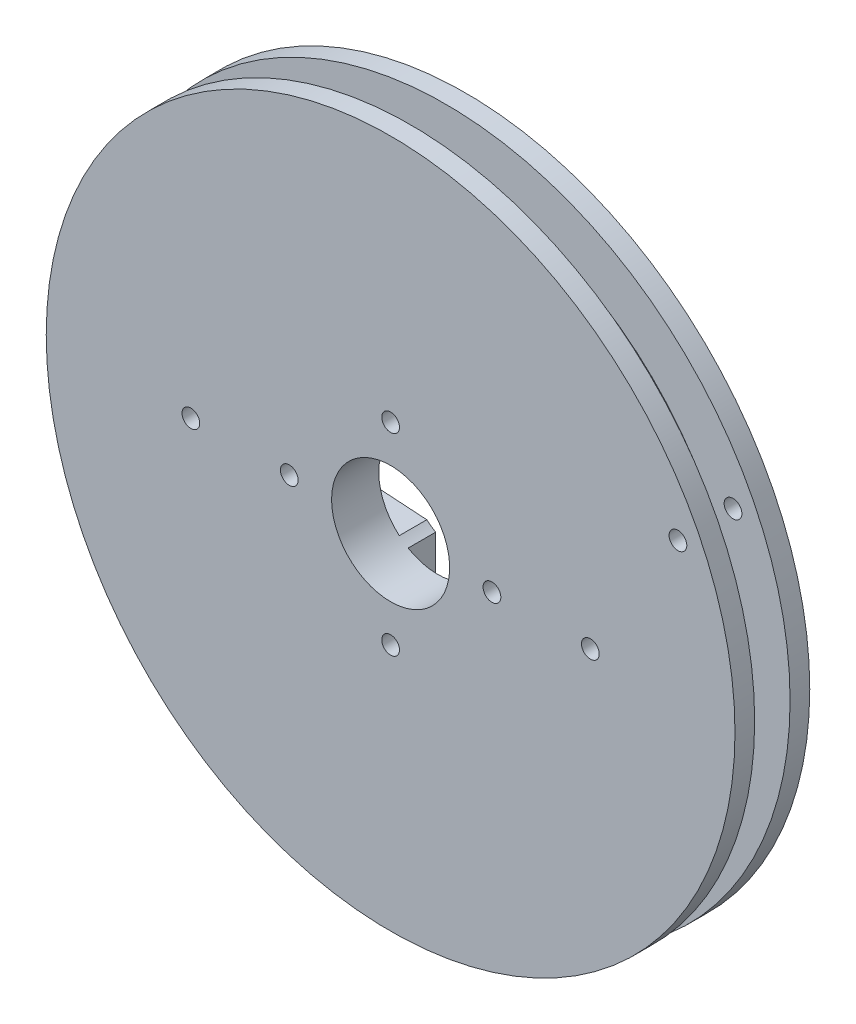
ISO-10303-21;
HEADER;
FILE_DESCRIPTION(('STEP AP214'),'2;1');
FILE_NAME('part.step','',(''),(''),'','','');
FILE_SCHEMA(('AUTOMOTIVE_DESIGN { 1 0 10303 214 1 1 1 1 }'));
ENDSEC;
DATA;
#1=APPLICATION_CONTEXT('core data for automotive mechanical design processes');
#2=APPLICATION_PROTOCOL_DEFINITION('international standard','automotive_design',2000,#1);
#3=PRODUCT_CONTEXT('',#1,'mechanical');
#4=PRODUCT('Part','Part','',(#3));
#5=PRODUCT_RELATED_PRODUCT_CATEGORY('part','',(#4));
#6=PRODUCT_DEFINITION_FORMATION('','',#4);
#7=PRODUCT_DEFINITION_CONTEXT('part definition',#1,'design');
#8=PRODUCT_DEFINITION('design','',#6,#7);
#9=PRODUCT_DEFINITION_SHAPE('','',#8);
#10=(LENGTH_UNIT() NAMED_UNIT(*) SI_UNIT(.MILLI.,.METRE.));
#11=(NAMED_UNIT(*) PLANE_ANGLE_UNIT() SI_UNIT($,.RADIAN.));
#12=(NAMED_UNIT(*) SI_UNIT($,.STERADIAN.) SOLID_ANGLE_UNIT());
#13=UNCERTAINTY_MEASURE_WITH_UNIT(LENGTH_MEASURE(1.E-05),#10,'distance_accuracy_value','');
#14=(GEOMETRIC_REPRESENTATION_CONTEXT(3) GLOBAL_UNCERTAINTY_ASSIGNED_CONTEXT((#13)) GLOBAL_UNIT_ASSIGNED_CONTEXT((#10,
#11,#12)) REPRESENTATION_CONTEXT('',''));
#15=CARTESIAN_POINT('',(0.,0.,0.));
#16=DIRECTION('',(0.,0.,1.));
#17=DIRECTION('',(1.,0.,0.));
#18=AXIS2_PLACEMENT_3D('',#15,#16,#17);
#19=CARTESIAN_POINT('',(0.,0.,1.143));
#20=DIRECTION('',(0.,0.,-1.));
#21=DIRECTION('',(-1.,0.,0.));
#22=AXIS2_PLACEMENT_3D('',#19,#20,#21);
#23=CYLINDRICAL_SURFACE('',#22,19.05);
#24=CARTESIAN_POINT('',(0.,0.,1.143));
#25=DIRECTION('',(0.,0.,1.));
#26=DIRECTION('',(1.,0.,0.));
#27=AXIS2_PLACEMENT_3D('',#24,#25,#26);
#28=CIRCLE('',#27,19.05);
#29=CARTESIAN_POINT('',(19.05,0.,1.143));
#30=VERTEX_POINT('',#29);
#31=EDGE_CURVE('E46',#30,#30,#28,.T.);
#32=ORIENTED_EDGE('',*,*,#31,.F.);
#33=EDGE_LOOP('',(#32));
#34=FACE_BOUND('',#33,.T.);
#35=CARTESIAN_POINT('',(0.,0.,-1.143));
#36=DIRECTION('',(0.,0.,1.));
#37=DIRECTION('',(1.,0.,0.));
#38=AXIS2_PLACEMENT_3D('',#35,#36,#37);
#39=CIRCLE('',#38,19.05);
#40=CARTESIAN_POINT('',(19.05,0.,-1.143));
#41=VERTEX_POINT('',#40);
#42=EDGE_CURVE('E237',#41,#41,#39,.T.);
#43=ORIENTED_EDGE('',*,*,#42,.T.);
#44=EDGE_LOOP('',(#43));
#45=FACE_BOUND('',#44,.T.);
#46=ADVANCED_FACE('F39',(#34,#45),#23,.T.);
#47=CARTESIAN_POINT('',(0.,0.,2.413));
#48=DIRECTION('',(0.,0.,-1.));
#49=DIRECTION('',(-1.,0.,0.));
#50=AXIS2_PLACEMENT_3D('',#47,#48,#49);
#51=CYLINDRICAL_SURFACE('',#50,22.225);
#52=CARTESIAN_POINT('',(0.,0.,2.413));
#53=DIRECTION('',(0.,0.,1.));
#54=DIRECTION('',(1.,0.,0.));
#55=AXIS2_PLACEMENT_3D('',#52,#53,#54);
#56=CIRCLE('',#55,22.225);
#57=CARTESIAN_POINT('',(22.225,0.,2.413));
#58=VERTEX_POINT('',#57);
#59=EDGE_CURVE('E240',#58,#58,#56,.T.);
#60=ORIENTED_EDGE('',*,*,#59,.F.);
#61=EDGE_LOOP('',(#60));
#62=FACE_BOUND('',#61,.T.);
#63=CARTESIAN_POINT('',(0.,0.,1.143));
#64=DIRECTION('',(0.,0.,1.));
#65=DIRECTION('',(1.,0.,0.));
#66=AXIS2_PLACEMENT_3D('',#63,#64,#65);
#67=CIRCLE('',#66,22.225);
#68=CARTESIAN_POINT('',(22.225,0.,1.143));
#69=VERTEX_POINT('',#68);
#70=EDGE_CURVE('E243',#69,#69,#67,.T.);
#71=ORIENTED_EDGE('',*,*,#70,.T.);
#72=EDGE_LOOP('',(#71));
#73=FACE_BOUND('',#72,.T.);
#74=ADVANCED_FACE('F279',(#62,#73),#51,.T.);
#75=CARTESIAN_POINT('',(0.,0.,2.413));
#76=DIRECTION('',(0.,0.,1.));
#77=DIRECTION('',(1.,0.,0.));
#78=AXIS2_PLACEMENT_3D('',#75,#76,#77);
#79=PLANE('',#78);
#80=CARTESIAN_POINT('',(0.,0.,2.413));
#81=DIRECTION('',(0.,0.,-1.));
#82=DIRECTION('',(-1.,0.,0.));
#83=AXIS2_PLACEMENT_3D('',#80,#81,#82);
#84=CIRCLE('',#83,3.81);
#85=CARTESIAN_POINT('',(-3.81,0.,2.413));
#86=VERTEX_POINT('',#85);
#87=EDGE_CURVE('E320',#86,#86,#84,.T.);
#88=ORIENTED_EDGE('',*,*,#87,.T.);
#89=EDGE_LOOP('',(#88));
#90=FACE_BOUND('',#89,.T.);
#91=CARTESIAN_POINT('',(0.,6.223,2.413));
#92=DIRECTION('',(0.,0.,-1.));
#93=DIRECTION('',(-1.,0.,0.));
#94=AXIS2_PLACEMENT_3D('',#91,#92,#93);
#95=CIRCLE('',#94,0.571499999999999);
#96=CARTESIAN_POINT('',(-0.571500000000004,6.223,2.413));
#97=VERTEX_POINT('',#96);
#98=EDGE_CURVE('E256',#97,#97,#95,.T.);
#99=ORIENTED_EDGE('',*,*,#98,.T.);
#100=EDGE_LOOP('',(#99));
#101=FACE_BOUND('',#100,.T.);
#102=CARTESIAN_POINT('',(0.,-6.223,2.413));
#103=DIRECTION('',(0.,0.,-1.));
#104=DIRECTION('',(-1.,0.,0.));
#105=AXIS2_PLACEMENT_3D('',#102,#103,#104);
#106=CIRCLE('',#105,0.571499999999999);
#107=CARTESIAN_POINT('',(-0.571500000000004,-6.223,2.413));
#108=VERTEX_POINT('',#107);
#109=EDGE_CURVE('E326',#108,#108,#106,.T.);
#110=ORIENTED_EDGE('',*,*,#109,.T.);
#111=EDGE_LOOP('',(#110));
#112=FACE_BOUND('',#111,.T.);
#113=CARTESIAN_POINT('',(18.542,8.89,2.413));
#114=DIRECTION('',(0.,0.,-1.));
#115=DIRECTION('',(-1.,0.,0.));
#116=AXIS2_PLACEMENT_3D('',#113,#114,#115);
#117=CIRCLE('',#116,0.571499999999999);
#118=CARTESIAN_POINT('',(17.9705,8.89,2.413));
#119=VERTEX_POINT('',#118);
#120=EDGE_CURVE('E212',#119,#119,#117,.T.);
#121=ORIENTED_EDGE('',*,*,#120,.T.);
#122=EDGE_LOOP('',(#121));
#123=FACE_BOUND('',#122,.T.);
#124=CARTESIAN_POINT('',(-12.8905,0.,2.413));
#125=DIRECTION('',(0.,0.,-1.));
#126=DIRECTION('',(-1.,0.,0.));
#127=AXIS2_PLACEMENT_3D('',#124,#125,#126);
#128=CIRCLE('',#127,0.571499999999999);
#129=CARTESIAN_POINT('',(-13.462,0.,2.413));
#130=VERTEX_POINT('',#129);
#131=EDGE_CURVE('E222',#130,#130,#128,.T.);
#132=ORIENTED_EDGE('',*,*,#131,.T.);
#133=EDGE_LOOP('',(#132));
#134=FACE_BOUND('',#133,.T.);
#135=CARTESIAN_POINT('',(6.5405,0.,2.413));
#136=DIRECTION('',(0.,0.,-1.));
#137=DIRECTION('',(1.,0.,0.));
#138=AXIS2_PLACEMENT_3D('',#135,#136,#137);
#139=CIRCLE('',#138,0.571499999999999);
#140=CARTESIAN_POINT('',(7.112,0.,2.413));
#141=VERTEX_POINT('',#140);
#142=EDGE_CURVE('E221',#141,#141,#139,.T.);
#143=ORIENTED_EDGE('',*,*,#142,.T.);
#144=EDGE_LOOP('',(#143));
#145=FACE_BOUND('',#144,.T.);
#146=CARTESIAN_POINT('',(12.8905,0.,2.413));
#147=DIRECTION('',(0.,0.,-1.));
#148=DIRECTION('',(1.,0.,0.));
#149=AXIS2_PLACEMENT_3D('',#146,#147,#148);
#150=CIRCLE('',#149,0.571499999999999);
#151=CARTESIAN_POINT('',(13.462,0.,2.413));
#152=VERTEX_POINT('',#151);
#153=EDGE_CURVE('E229',#152,#152,#150,.T.);
#154=ORIENTED_EDGE('',*,*,#153,.T.);
#155=EDGE_LOOP('',(#154));
#156=FACE_BOUND('',#155,.T.);
#157=CARTESIAN_POINT('',(-6.5405,0.,2.413));
#158=DIRECTION('',(0.,0.,-1.));
#159=DIRECTION('',(-1.,0.,0.));
#160=AXIS2_PLACEMENT_3D('',#157,#158,#159);
#161=CIRCLE('',#160,0.5715);
#162=CARTESIAN_POINT('',(-7.112,0.,2.413));
#163=VERTEX_POINT('',#162);
#164=EDGE_CURVE('E226',#163,#163,#161,.T.);
#165=ORIENTED_EDGE('',*,*,#164,.T.);
#166=EDGE_LOOP('',(#165));
#167=FACE_BOUND('',#166,.T.);
#168=ORIENTED_EDGE('',*,*,#59,.T.);
#169=EDGE_LOOP('',(#168));
#170=FACE_BOUND('',#169,.T.);
#171=ADVANCED_FACE('F284',(#90,#101,#112,#123,#134,#145,#156,#167,#170),#79,.T.);
#172=CARTESIAN_POINT('',(0.,0.,1.143));
#173=DIRECTION('',(0.,0.,1.));
#174=DIRECTION('',(1.,0.,0.));
#175=AXIS2_PLACEMENT_3D('',#172,#173,#174);
#176=PLANE('',#175);
#177=CARTESIAN_POINT('',(18.542,8.89,1.143));
#178=DIRECTION('',(0.,0.,1.));
#179=DIRECTION('',(1.,0.,0.));
#180=AXIS2_PLACEMENT_3D('',#177,#178,#179);
#181=CIRCLE('',#180,0.571499999999999);
#182=CARTESIAN_POINT('',(19.1135,8.89,1.143));
#183=VERTEX_POINT('',#182);
#184=EDGE_CURVE('E218',#183,#183,#181,.T.);
#185=ORIENTED_EDGE('',*,*,#184,.T.);
#186=EDGE_LOOP('',(#185));
#187=FACE_BOUND('',#186,.T.);
#188=ORIENTED_EDGE('',*,*,#31,.T.);
#189=EDGE_LOOP('',(#188));
#190=FACE_BOUND('',#189,.T.);
#191=ORIENTED_EDGE('',*,*,#70,.F.);
#192=EDGE_LOOP('',(#191));
#193=FACE_BOUND('',#192,.T.);
#194=ADVANCED_FACE('F301',(#187,#190,#193),#176,.F.);
#195=CARTESIAN_POINT('',(0.,0.,-2.413));
#196=DIRECTION('',(0.,0.,1.));
#197=DIRECTION('',(1.,0.,0.));
#198=AXIS2_PLACEMENT_3D('',#195,#196,#197);
#199=CYLINDRICAL_SURFACE('',#198,22.225);
#200=CARTESIAN_POINT('',(0.,0.,-2.413));
#201=DIRECTION('',(0.,0.,1.));
#202=DIRECTION('',(1.,0.,0.));
#203=AXIS2_PLACEMENT_3D('',#200,#201,#202);
#204=CIRCLE('',#203,22.225);
#205=CARTESIAN_POINT('',(22.225,0.,-2.413));
#206=VERTEX_POINT('',#205);
#207=EDGE_CURVE('E234',#206,#206,#204,.T.);
#208=ORIENTED_EDGE('',*,*,#207,.T.);
#209=EDGE_LOOP('',(#208));
#210=FACE_BOUND('',#209,.T.);
#211=CARTESIAN_POINT('',(0.,0.,-1.143));
#212=DIRECTION('',(0.,0.,1.));
#213=DIRECTION('',(1.,0.,0.));
#214=AXIS2_PLACEMENT_3D('',#211,#212,#213);
#215=CIRCLE('',#214,22.225);
#216=CARTESIAN_POINT('',(22.225,0.,-1.143));
#217=VERTEX_POINT('',#216);
#218=EDGE_CURVE('E225',#217,#217,#215,.T.);
#219=ORIENTED_EDGE('',*,*,#218,.F.);
#220=EDGE_LOOP('',(#219));
#221=FACE_BOUND('',#220,.T.);
#222=ADVANCED_FACE('F299',(#210,#221),#199,.T.);
#223=CARTESIAN_POINT('',(0.,0.,-2.413));
#224=DIRECTION('',(0.,0.,-1.));
#225=DIRECTION('',(1.,0.,0.));
#226=AXIS2_PLACEMENT_3D('',#223,#224,#225);
#227=PLANE('',#226);
#228=CARTESIAN_POINT('',(0.,0.,-2.413));
#229=DIRECTION('',(0.,0.,-1.));
#230=DIRECTION('',(-1.,0.,0.));
#231=AXIS2_PLACEMENT_3D('',#228,#229,#230);
#232=CIRCLE('',#231,3.81);
#233=CARTESIAN_POINT('',(-2.48973260777059,2.88397842256211,-2.413));
#234=VERTEX_POINT('',#233);
#235=CARTESIAN_POINT('',(-1.9177,3.29219177904326,-2.413));
#236=VERTEX_POINT('',#235);
#237=EDGE_CURVE('E696',#234,#236,#232,.T.);
#238=ORIENTED_EDGE('',*,*,#237,.F.);
#239=DIRECTION('',(0.99791225923342,0.0645842308280507,0.));
#240=VECTOR('',#239,1.);
#241=CARTESIAN_POINT('',(-14.6727728627614,2.0955,-2.413));
#242=LINE('',#241,#240);
#243=CARTESIAN_POINT('',(-14.6727728627614,2.0955,-2.413));
#244=VERTEX_POINT('',#243);
#245=EDGE_CURVE('E177',#244,#234,#242,.T.);
#246=ORIENTED_EDGE('',*,*,#245,.F.);
#247=CARTESIAN_POINT('',(-14.2441036652242,0.,-2.413));
#248=DIRECTION('',(0.,0.,-1.));
#249=DIRECTION('',(-1.,0.,0.));
#250=AXIS2_PLACEMENT_3D('',#247,#248,#249);
#251=CIRCLE('',#250,2.13889633477575);
#252=CARTESIAN_POINT('',(-14.6727728627614,-2.0955,-2.413));
#253=VERTEX_POINT('',#252);
#254=EDGE_CURVE('E174',#253,#244,#251,.T.);
#255=ORIENTED_EDGE('',*,*,#254,.F.);
#256=DIRECTION('',(-0.99791225923342,0.0645842308280507,0.));
#257=VECTOR('',#256,1.);
#258=CARTESIAN_POINT('',(-14.6727728627614,-2.0955,-2.413));
#259=LINE('',#258,#257);
#260=CARTESIAN_POINT('',(-2.48973260777059,-2.88397842256211,-2.413));
#261=VERTEX_POINT('',#260);
#262=EDGE_CURVE('E172',#261,#253,#259,.T.);
#263=ORIENTED_EDGE('',*,*,#262,.F.);
#264=CARTESIAN_POINT('',(-1.9177,-3.29219177904326,-2.413));
#265=VERTEX_POINT('',#264);
#266=EDGE_CURVE('E698',#265,#261,#232,.T.);
#267=ORIENTED_EDGE('',*,*,#266,.F.);
#268=DIRECTION('',(0.,1.,0.));
#269=VECTOR('',#268,1.);
#270=CARTESIAN_POINT('',(-1.9177,-2.921,-2.413));
#271=LINE('',#270,#269);
#272=CARTESIAN_POINT('',(-1.9177,-6.4262,-2.413));
#273=VERTEX_POINT('',#272);
#274=EDGE_CURVE('E169',#273,#265,#271,.T.);
#275=ORIENTED_EDGE('',*,*,#274,.F.);
#276=CARTESIAN_POINT('',(0.,-6.4262,-2.413));
#277=DIRECTION('',(0.,0.,-1.));
#278=DIRECTION('',(-1.,0.,0.));
#279=AXIS2_PLACEMENT_3D('',#276,#277,#278);
#280=CIRCLE('',#279,1.9177);
#281=CARTESIAN_POINT('',(1.9177,-6.4262,-2.413));
#282=VERTEX_POINT('',#281);
#283=EDGE_CURVE('E166',#282,#273,#280,.T.);
#284=ORIENTED_EDGE('',*,*,#283,.F.);
#285=DIRECTION('',(0.,-1.,0.));
#286=VECTOR('',#285,1.);
#287=CARTESIAN_POINT('',(1.9177,-3.6195,-2.413));
#288=LINE('',#287,#286);
#289=CARTESIAN_POINT('',(1.9177,-3.6195,-2.413));
#290=VERTEX_POINT('',#289);
#291=EDGE_CURVE('E163',#290,#282,#288,.T.);
#292=ORIENTED_EDGE('',*,*,#291,.F.);
#293=DIRECTION('',(-0.994868229274418,-0.101179080744909,0.));
#294=VECTOR('',#293,1.);
#295=CARTESIAN_POINT('',(16.9028053226781,-2.0955,-2.413));
#296=LINE('',#295,#294);
#297=CARTESIAN_POINT('',(16.9028053226781,-2.0955,-2.413));
#298=VERTEX_POINT('',#297);
#299=EDGE_CURVE('E160',#298,#290,#296,.T.);
#300=ORIENTED_EDGE('',*,*,#299,.F.);
#301=CARTESIAN_POINT('',(16.6896909046454,0.,-2.413));
#302=DIRECTION('',(0.,0.,-1.));
#303=DIRECTION('',(1.,0.,0.));
#304=AXIS2_PLACEMENT_3D('',#301,#302,#303);
#305=CIRCLE('',#304,2.10630909535457);
#306=CARTESIAN_POINT('',(16.9028053226781,2.0955,-2.413));
#307=VERTEX_POINT('',#306);
#308=EDGE_CURVE('E156',#307,#298,#305,.T.);
#309=ORIENTED_EDGE('',*,*,#308,.F.);
#310=DIRECTION('',(0.994868229274418,-0.101179080744909,0.));
#311=VECTOR('',#310,1.);
#312=CARTESIAN_POINT('',(16.9028053226781,2.0955,-2.413));
#313=LINE('',#312,#311);
#314=CARTESIAN_POINT('',(1.9177,3.6195,-2.413));
#315=VERTEX_POINT('',#314);
#316=EDGE_CURVE('E154',#315,#307,#313,.T.);
#317=ORIENTED_EDGE('',*,*,#316,.F.);
#318=DIRECTION('',(0.,-1.,0.));
#319=VECTOR('',#318,1.);
#320=CARTESIAN_POINT('',(1.9177,3.6195,-2.413));
#321=LINE('',#320,#319);
#322=CARTESIAN_POINT('',(1.9177,6.4262,-2.413));
#323=VERTEX_POINT('',#322);
#324=EDGE_CURVE('E183',#323,#315,#321,.T.);
#325=ORIENTED_EDGE('',*,*,#324,.F.);
#326=CARTESIAN_POINT('',(0.,6.4262,-2.413));
#327=DIRECTION('',(0.,0.,-1.));
#328=DIRECTION('',(1.,0.,0.));
#329=AXIS2_PLACEMENT_3D('',#326,#327,#328);
#330=CIRCLE('',#329,1.9177);
#331=CARTESIAN_POINT('',(-1.9177,6.4262,-2.413));
#332=VERTEX_POINT('',#331);
#333=EDGE_CURVE('E181',#332,#323,#330,.T.);
#334=ORIENTED_EDGE('',*,*,#333,.F.);
#335=DIRECTION('',(0.,1.,0.));
#336=VECTOR('',#335,1.);
#337=CARTESIAN_POINT('',(-1.9177,2.921,-2.413));
#338=LINE('',#337,#336);
#339=EDGE_CURVE('E141',#236,#332,#338,.T.);
#340=ORIENTED_EDGE('',*,*,#339,.F.);
#341=EDGE_LOOP('',(#238,#246,#255,#263,#267,#275,#284,#292,#300,#309,#317,#325,#334,#340));
#342=FACE_BOUND('',#341,.T.);
#343=CARTESIAN_POINT('',(18.542,8.89,-2.413));
#344=DIRECTION('',(0.,0.,-1.));
#345=DIRECTION('',(-1.,0.,0.));
#346=AXIS2_PLACEMENT_3D('',#343,#344,#345);
#347=CIRCLE('',#346,0.571499999999999);
#348=CARTESIAN_POINT('',(17.9705,8.89,-2.413));
#349=VERTEX_POINT('',#348);
#350=EDGE_CURVE('E211',#349,#349,#347,.T.);
#351=ORIENTED_EDGE('',*,*,#350,.F.);
#352=EDGE_LOOP('',(#351));
#353=FACE_BOUND('',#352,.T.);
#354=ORIENTED_EDGE('',*,*,#207,.F.);
#355=EDGE_LOOP('',(#354));
#356=FACE_BOUND('',#355,.T.);
#357=ADVANCED_FACE('F294',(#342,#353,#356),#227,.T.);
#358=CARTESIAN_POINT('',(0.,0.,-1.143));
#359=DIRECTION('',(0.,0.,-1.));
#360=DIRECTION('',(1.,0.,0.));
#361=AXIS2_PLACEMENT_3D('',#358,#359,#360);
#362=PLANE('',#361);
#363=CARTESIAN_POINT('',(18.542,8.89,-1.143));
#364=DIRECTION('',(0.,0.,-1.));
#365=DIRECTION('',(-1.,0.,0.));
#366=AXIS2_PLACEMENT_3D('',#363,#364,#365);
#367=CIRCLE('',#366,0.571499999999999);
#368=CARTESIAN_POINT('',(17.9705,8.89,-1.143));
#369=VERTEX_POINT('',#368);
#370=EDGE_CURVE('E215',#369,#369,#367,.T.);
#371=ORIENTED_EDGE('',*,*,#370,.T.);
#372=EDGE_LOOP('',(#371));
#373=FACE_BOUND('',#372,.T.);
#374=ORIENTED_EDGE('',*,*,#42,.F.);
#375=EDGE_LOOP('',(#374));
#376=FACE_BOUND('',#375,.T.);
#377=ORIENTED_EDGE('',*,*,#218,.T.);
#378=EDGE_LOOP('',(#377));
#379=FACE_BOUND('',#378,.T.);
#380=ADVANCED_FACE('F290',(#373,#376,#379),#362,.F.);
#381=CARTESIAN_POINT('',(-6.5405,0.,2.413));
#382=DIRECTION('',(0.,0.,-1.));
#383=DIRECTION('',(-1.,0.,0.));
#384=AXIS2_PLACEMENT_3D('',#381,#382,#383);
#385=CYLINDRICAL_SURFACE('',#384,0.5715);
#386=CARTESIAN_POINT('',(-6.5405,0.,-0.635));
#387=DIRECTION('',(0.,0.,1.));
#388=DIRECTION('',(1.,0.,0.));
#389=AXIS2_PLACEMENT_3D('',#386,#387,#388);
#390=CIRCLE('',#389,0.5715);
#391=CARTESIAN_POINT('',(-5.969,0.,-0.635));
#392=VERTEX_POINT('',#391);
#393=EDGE_CURVE('E208',#392,#392,#390,.F.);
#394=ORIENTED_EDGE('',*,*,#393,.T.);
#395=EDGE_LOOP('',(#394));
#396=FACE_BOUND('',#395,.T.);
#397=ORIENTED_EDGE('',*,*,#164,.F.);
#398=EDGE_LOOP('',(#397));
#399=FACE_BOUND('',#398,.T.);
#400=ADVANCED_FACE('F293',(#396,#399),#385,.F.);
#401=CARTESIAN_POINT('',(12.8905,0.,2.413));
#402=DIRECTION('',(0.,0.,-1.));
#403=DIRECTION('',(-1.,0.,0.));
#404=AXIS2_PLACEMENT_3D('',#401,#402,#403);
#405=CYLINDRICAL_SURFACE('',#404,0.571499999999999);
#406=CARTESIAN_POINT('',(12.8905,0.,-0.635));
#407=DIRECTION('',(0.,0.,1.));
#408=DIRECTION('',(1.,0.,0.));
#409=AXIS2_PLACEMENT_3D('',#406,#407,#408);
#410=CIRCLE('',#409,0.571499999999999);
#411=CARTESIAN_POINT('',(13.462,0.,-0.635));
#412=VERTEX_POINT('',#411);
#413=EDGE_CURVE('E205',#412,#412,#410,.F.);
#414=ORIENTED_EDGE('',*,*,#413,.T.);
#415=EDGE_LOOP('',(#414));
#416=FACE_BOUND('',#415,.T.);
#417=ORIENTED_EDGE('',*,*,#153,.F.);
#418=EDGE_LOOP('',(#417));
#419=FACE_BOUND('',#418,.T.);
#420=ADVANCED_FACE('F343',(#416,#419),#405,.F.);
#421=CARTESIAN_POINT('',(6.5405,0.,2.413));
#422=DIRECTION('',(0.,0.,-1.));
#423=DIRECTION('',(-1.,0.,0.));
#424=AXIS2_PLACEMENT_3D('',#421,#422,#423);
#425=CYLINDRICAL_SURFACE('',#424,0.571499999999999);
#426=CARTESIAN_POINT('',(6.5405,0.,-0.635));
#427=DIRECTION('',(0.,0.,1.));
#428=DIRECTION('',(1.,0.,0.));
#429=AXIS2_PLACEMENT_3D('',#426,#427,#428);
#430=CIRCLE('',#429,0.571499999999999);
#431=CARTESIAN_POINT('',(7.112,0.,-0.635));
#432=VERTEX_POINT('',#431);
#433=EDGE_CURVE('E202',#432,#432,#430,.F.);
#434=ORIENTED_EDGE('',*,*,#433,.T.);
#435=EDGE_LOOP('',(#434));
#436=FACE_BOUND('',#435,.T.);
#437=ORIENTED_EDGE('',*,*,#142,.F.);
#438=EDGE_LOOP('',(#437));
#439=FACE_BOUND('',#438,.T.);
#440=ADVANCED_FACE('F349',(#436,#439),#425,.F.);
#441=CARTESIAN_POINT('',(-12.8905,0.,2.413));
#442=DIRECTION('',(0.,0.,-1.));
#443=DIRECTION('',(-1.,0.,0.));
#444=AXIS2_PLACEMENT_3D('',#441,#442,#443);
#445=CYLINDRICAL_SURFACE('',#444,0.571499999999999);
#446=CARTESIAN_POINT('',(-12.8905,0.,-0.635));
#447=DIRECTION('',(0.,0.,1.));
#448=DIRECTION('',(1.,0.,0.));
#449=AXIS2_PLACEMENT_3D('',#446,#447,#448);
#450=CIRCLE('',#449,0.571499999999999);
#451=CARTESIAN_POINT('',(-12.319,0.,-0.635));
#452=VERTEX_POINT('',#451);
#453=EDGE_CURVE('E187',#452,#452,#450,.F.);
#454=ORIENTED_EDGE('',*,*,#453,.T.);
#455=EDGE_LOOP('',(#454));
#456=FACE_BOUND('',#455,.T.);
#457=ORIENTED_EDGE('',*,*,#131,.F.);
#458=EDGE_LOOP('',(#457));
#459=FACE_BOUND('',#458,.T.);
#460=ADVANCED_FACE('F355',(#456,#459),#445,.F.);
#461=CARTESIAN_POINT('',(18.542,8.89,2.413));
#462=DIRECTION('',(0.,0.,-1.));
#463=DIRECTION('',(-1.,0.,0.));
#464=AXIS2_PLACEMENT_3D('',#461,#462,#463);
#465=CYLINDRICAL_SURFACE('',#464,0.571499999999999);
#466=ORIENTED_EDGE('',*,*,#350,.T.);
#467=EDGE_LOOP('',(#466));
#468=FACE_BOUND('',#467,.T.);
#469=ORIENTED_EDGE('',*,*,#370,.F.);
#470=EDGE_LOOP('',(#469));
#471=FACE_BOUND('',#470,.T.);
#472=ADVANCED_FACE('F359',(#468,#471),#465,.F.);
#473=ORIENTED_EDGE('',*,*,#120,.F.);
#474=EDGE_LOOP('',(#473));
#475=FACE_BOUND('',#474,.T.);
#476=ORIENTED_EDGE('',*,*,#184,.F.);
#477=EDGE_LOOP('',(#476));
#478=FACE_BOUND('',#477,.T.);
#479=ADVANCED_FACE('F361',(#475,#478),#465,.F.);
#480=CARTESIAN_POINT('',(0.,6.4262,-0.635));
#481=DIRECTION('',(0.,0.,1.));
#482=DIRECTION('',(1.,0.,0.));
#483=AXIS2_PLACEMENT_3D('',#480,#481,#482);
#484=PLANE('',#483);
#485=ORIENTED_EDGE('',*,*,#453,.F.);
#486=EDGE_LOOP('',(#485));
#487=FACE_BOUND('',#486,.T.);
#488=ORIENTED_EDGE('',*,*,#393,.F.);
#489=EDGE_LOOP('',(#488));
#490=FACE_BOUND('',#489,.T.);
#491=DIRECTION('',(0.99791225923342,0.0645842308280507,0.));
#492=VECTOR('',#491,1.);
#493=CARTESIAN_POINT('',(-14.6727728627614,2.0955,-0.635));
#494=LINE('',#493,#492);
#495=CARTESIAN_POINT('',(-14.6727728627614,2.0955,-0.635));
#496=VERTEX_POINT('',#495);
#497=CARTESIAN_POINT('',(-2.48973260777059,2.88397842256211,-0.635));
#498=VERTEX_POINT('',#497);
#499=EDGE_CURVE('E135',#496,#498,#494,.T.);
#500=ORIENTED_EDGE('',*,*,#499,.T.);
#501=CARTESIAN_POINT('',(0.,0.,-0.635));
#502=DIRECTION('',(0.,0.,1.));
#503=DIRECTION('',(1.,0.,0.));
#504=AXIS2_PLACEMENT_3D('',#501,#502,#503);
#505=CIRCLE('',#504,3.81);
#506=CARTESIAN_POINT('',(-2.48973260777059,-2.88397842256211,-0.635));
#507=VERTEX_POINT('',#506);
#508=EDGE_CURVE('E658',#498,#507,#505,.T.);
#509=ORIENTED_EDGE('',*,*,#508,.T.);
#510=DIRECTION('',(-0.99791225923342,0.0645842308280507,0.));
#511=VECTOR('',#510,1.);
#512=CARTESIAN_POINT('',(-14.6727728627614,-2.0955,-0.635));
#513=LINE('',#512,#511);
#514=CARTESIAN_POINT('',(-14.6727728627614,-2.0955,-0.635));
#515=VERTEX_POINT('',#514);
#516=EDGE_CURVE('E664',#507,#515,#513,.T.);
#517=ORIENTED_EDGE('',*,*,#516,.T.);
#518=CARTESIAN_POINT('',(-14.2441036652242,0.,-0.635));
#519=DIRECTION('',(0.,0.,-1.));
#520=DIRECTION('',(-1.,0.,0.));
#521=AXIS2_PLACEMENT_3D('',#518,#519,#520);
#522=CIRCLE('',#521,2.13889633477575);
#523=EDGE_CURVE('E661',#515,#496,#522,.T.);
#524=ORIENTED_EDGE('',*,*,#523,.T.);
#525=EDGE_LOOP('',(#500,#509,#517,#524));
#526=FACE_BOUND('',#525,.T.);
#527=ADVANCED_FACE('F364',(#487,#490,#526),#484,.F.);
#528=CARTESIAN_POINT('',(-14.6727728627614,-2.0955,-0.635));
#529=DIRECTION('',(-0.0645842308280507,-0.99791225923342,0.));
#530=DIRECTION('',(0.99791225923342,-0.0645842308280507,0.));
#531=AXIS2_PLACEMENT_3D('',#528,#529,#530);
#532=PLANE('',#531);
#533=ORIENTED_EDGE('',*,*,#516,.F.);
#534=DIRECTION('',(0.,0.,-1.));
#535=VECTOR('',#534,1.);
#536=CARTESIAN_POINT('',(-2.48973260777059,-2.88397842256211,2.413));
#537=LINE('',#536,#535);
#538=EDGE_CURVE('E685',#507,#261,#537,.T.);
#539=ORIENTED_EDGE('',*,*,#538,.T.);
#540=ORIENTED_EDGE('',*,*,#262,.T.);
#541=DIRECTION('',(0.,0.,-1.));
#542=VECTOR('',#541,1.);
#543=CARTESIAN_POINT('',(-14.6727728627614,-2.0955,-0.635));
#544=LINE('',#543,#542);
#545=EDGE_CURVE('E190',#515,#253,#544,.T.);
#546=ORIENTED_EDGE('',*,*,#545,.F.);
#547=EDGE_LOOP('',(#533,#539,#540,#546));
#548=FACE_BOUND('',#547,.T.);
#549=ADVANCED_FACE('F389',(#548),#532,.F.);
#550=CARTESIAN_POINT('',(-14.6727728627614,2.0955,-0.635));
#551=DIRECTION('',(-0.0645842308280507,0.99791225923342,0.));
#552=DIRECTION('',(-0.99791225923342,-0.0645842308280507,0.));
#553=AXIS2_PLACEMENT_3D('',#550,#551,#552);
#554=PLANE('',#553);
#555=ORIENTED_EDGE('',*,*,#245,.T.);
#556=DIRECTION('',(0.,0.,-1.));
#557=VECTOR('',#556,1.);
#558=CARTESIAN_POINT('',(-2.48973260777059,2.88397842256211,2.413));
#559=LINE('',#558,#557);
#560=EDGE_CURVE('E690',#234,#498,#559,.F.);
#561=ORIENTED_EDGE('',*,*,#560,.T.);
#562=ORIENTED_EDGE('',*,*,#499,.F.);
#563=DIRECTION('',(0.,0.,-1.));
#564=VECTOR('',#563,1.);
#565=CARTESIAN_POINT('',(-14.6727728627614,2.0955,-0.635));
#566=LINE('',#565,#564);
#567=EDGE_CURVE('E146',#496,#244,#566,.T.);
#568=ORIENTED_EDGE('',*,*,#567,.T.);
#569=EDGE_LOOP('',(#555,#561,#562,#568));
#570=FACE_BOUND('',#569,.T.);
#571=ADVANCED_FACE('F392',(#570),#554,.F.);
#572=CARTESIAN_POINT('',(-14.2441036652242,0.,-0.635));
#573=DIRECTION('',(0.,0.,-1.));
#574=DIRECTION('',(-1.,0.,0.));
#575=AXIS2_PLACEMENT_3D('',#572,#573,#574);
#576=CYLINDRICAL_SURFACE('',#575,2.13889633477575);
#577=ORIENTED_EDGE('',*,*,#254,.T.);
#578=ORIENTED_EDGE('',*,*,#567,.F.);
#579=ORIENTED_EDGE('',*,*,#523,.F.);
#580=ORIENTED_EDGE('',*,*,#545,.T.);
#581=EDGE_LOOP('',(#577,#578,#579,#580));
#582=FACE_BOUND('',#581,.T.);
#583=ADVANCED_FACE('F394',(#582),#576,.F.);
#584=CARTESIAN_POINT('',(-1.9177,2.921,-0.635));
#585=DIRECTION('',(-1.,0.,0.));
#586=DIRECTION('',(0.,0.,1.));
#587=AXIS2_PLACEMENT_3D('',#584,#585,#586);
#588=PLANE('',#587);
#589=DIRECTION('',(0.,1.,0.));
#590=VECTOR('',#589,1.);
#591=CARTESIAN_POINT('',(-1.9177,2.921,-0.635));
#592=LINE('',#591,#590);
#593=CARTESIAN_POINT('',(-1.9177,3.29219177904326,-0.635));
#594=VERTEX_POINT('',#593);
#595=CARTESIAN_POINT('',(-1.9177,6.4262,-0.635));
#596=VERTEX_POINT('',#595);
#597=EDGE_CURVE('E127',#594,#596,#592,.T.);
#598=ORIENTED_EDGE('',*,*,#597,.F.);
#599=DIRECTION('',(0.,0.,-1.));
#600=VECTOR('',#599,1.);
#601=CARTESIAN_POINT('',(-1.9177,3.29219177904326,2.413));
#602=LINE('',#601,#600);
#603=EDGE_CURVE('E53',#594,#236,#602,.T.);
#604=ORIENTED_EDGE('',*,*,#603,.T.);
#605=ORIENTED_EDGE('',*,*,#339,.T.);
#606=DIRECTION('',(0.,0.,-1.));
#607=VECTOR('',#606,1.);
#608=CARTESIAN_POINT('',(-1.9177,6.4262,-0.635));
#609=LINE('',#608,#607);
#610=EDGE_CURVE('E138',#596,#332,#609,.T.);
#611=ORIENTED_EDGE('',*,*,#610,.F.);
#612=EDGE_LOOP('',(#598,#604,#605,#611));
#613=FACE_BOUND('',#612,.T.);
#614=ADVANCED_FACE('F139',(#613),#588,.F.);
#615=CARTESIAN_POINT('',(-1.9177,-2.921,-0.635));
#616=DIRECTION('',(-1.,0.,0.));
#617=DIRECTION('',(0.,0.,1.));
#618=AXIS2_PLACEMENT_3D('',#615,#616,#617);
#619=PLANE('',#618);
#620=ORIENTED_EDGE('',*,*,#274,.T.);
#621=DIRECTION('',(0.,0.,-1.));
#622=VECTOR('',#621,1.);
#623=CARTESIAN_POINT('',(-1.9177,-3.29219177904326,2.413));
#624=LINE('',#623,#622);
#625=CARTESIAN_POINT('',(-1.9177,-3.29219177904326,-0.635));
#626=VERTEX_POINT('',#625);
#627=EDGE_CURVE('E693',#265,#626,#624,.F.);
#628=ORIENTED_EDGE('',*,*,#627,.T.);
#629=DIRECTION('',(0.,1.,0.));
#630=VECTOR('',#629,1.);
#631=CARTESIAN_POINT('',(-1.9177,-2.921,-0.635));
#632=LINE('',#631,#630);
#633=CARTESIAN_POINT('',(-1.9177,-6.4262,-0.635));
#634=VERTEX_POINT('',#633);
#635=EDGE_CURVE('E668',#634,#626,#632,.T.);
#636=ORIENTED_EDGE('',*,*,#635,.F.);
#637=DIRECTION('',(0.,0.,-1.));
#638=VECTOR('',#637,1.);
#639=CARTESIAN_POINT('',(-1.9177,-6.4262,-0.635));
#640=LINE('',#639,#638);
#641=EDGE_CURVE('E193',#634,#273,#640,.T.);
#642=ORIENTED_EDGE('',*,*,#641,.T.);
#643=EDGE_LOOP('',(#620,#628,#636,#642));
#644=FACE_BOUND('',#643,.T.);
#645=ADVANCED_FACE('F385',(#644),#619,.F.);
#646=CARTESIAN_POINT('',(0.,6.223,-0.635));
#647=DIRECTION('',(0.,0.,1.));
#648=DIRECTION('',(1.,0.,0.));
#649=AXIS2_PLACEMENT_3D('',#646,#647,#648);
#650=CIRCLE('',#649,0.571499999999999);
#651=CARTESIAN_POINT('',(0.571499999999995,6.223,-0.635));
#652=VERTEX_POINT('',#651);
#653=EDGE_CURVE('E157',#652,#652,#650,.T.);
#654=ORIENTED_EDGE('',*,*,#653,.T.);
#655=EDGE_LOOP('',(#654));
#656=FACE_BOUND('',#655,.T.);
#657=CARTESIAN_POINT('',(0.,-6.223,-0.635));
#658=DIRECTION('',(0.,0.,1.));
#659=DIRECTION('',(1.,0.,0.));
#660=AXIS2_PLACEMENT_3D('',#657,#658,#659);
#661=CIRCLE('',#660,0.571499999999999);
#662=CARTESIAN_POINT('',(0.571499999999995,-6.223,-0.635));
#663=VERTEX_POINT('',#662);
#664=EDGE_CURVE('E254',#663,#663,#661,.T.);
#665=ORIENTED_EDGE('',*,*,#664,.T.);
#666=EDGE_LOOP('',(#665));
#667=FACE_BOUND('',#666,.T.);
#668=ORIENTED_EDGE('',*,*,#433,.F.);
#669=EDGE_LOOP('',(#668));
#670=FACE_BOUND('',#669,.T.);
#671=ORIENTED_EDGE('',*,*,#413,.F.);
#672=EDGE_LOOP('',(#671));
#673=FACE_BOUND('',#672,.T.);
#674=ORIENTED_EDGE('',*,*,#635,.T.);
#675=CARTESIAN_POINT('',(0.,0.,-0.635));
#676=DIRECTION('',(0.,0.,1.));
#677=DIRECTION('',(1.,0.,0.));
#678=AXIS2_PLACEMENT_3D('',#675,#676,#677);
#679=CIRCLE('',#678,3.81);
#680=EDGE_CURVE('E11',#626,#594,#679,.T.);
#681=ORIENTED_EDGE('',*,*,#680,.T.);
#682=ORIENTED_EDGE('',*,*,#597,.T.);
#683=CARTESIAN_POINT('',(0.,6.4262,-0.635));
#684=DIRECTION('',(0.,0.,-1.));
#685=DIRECTION('',(1.,0.,0.));
#686=AXIS2_PLACEMENT_3D('',#683,#684,#685);
#687=CIRCLE('',#686,1.9177);
#688=CARTESIAN_POINT('',(1.9177,6.4262,-0.635));
#689=VERTEX_POINT('',#688);
#690=EDGE_CURVE('E133',#596,#689,#687,.T.);
#691=ORIENTED_EDGE('',*,*,#690,.T.);
#692=DIRECTION('',(0.,-1.,0.));
#693=VECTOR('',#692,1.);
#694=CARTESIAN_POINT('',(1.9177,3.6195,-0.635));
#695=LINE('',#694,#693);
#696=CARTESIAN_POINT('',(1.9177,3.6195,-0.635));
#697=VERTEX_POINT('',#696);
#698=EDGE_CURVE('E149',#689,#697,#695,.T.);
#699=ORIENTED_EDGE('',*,*,#698,.T.);
#700=DIRECTION('',(0.994868229274418,-0.101179080744909,0.));
#701=VECTOR('',#700,1.);
#702=CARTESIAN_POINT('',(16.9028053226781,2.0955,-0.635));
#703=LINE('',#702,#701);
#704=CARTESIAN_POINT('',(16.9028053226781,2.0955,-0.635));
#705=VERTEX_POINT('',#704);
#706=EDGE_CURVE('E185',#697,#705,#703,.T.);
#707=ORIENTED_EDGE('',*,*,#706,.T.);
#708=CARTESIAN_POINT('',(16.6896909046454,0.,-0.635));
#709=DIRECTION('',(0.,0.,-1.));
#710=DIRECTION('',(1.,0.,0.));
#711=AXIS2_PLACEMENT_3D('',#708,#709,#710);
#712=CIRCLE('',#711,2.10630909535457);
#713=CARTESIAN_POINT('',(16.9028053226781,-2.0955,-0.635));
#714=VERTEX_POINT('',#713);
#715=EDGE_CURVE('E679',#705,#714,#712,.T.);
#716=ORIENTED_EDGE('',*,*,#715,.T.);
#717=DIRECTION('',(-0.994868229274418,-0.101179080744909,0.));
#718=VECTOR('',#717,1.);
#719=CARTESIAN_POINT('',(16.9028053226781,-2.0955,-0.635));
#720=LINE('',#719,#718);
#721=CARTESIAN_POINT('',(1.9177,-3.6195,-0.635));
#722=VERTEX_POINT('',#721);
#723=EDGE_CURVE('E676',#714,#722,#720,.T.);
#724=ORIENTED_EDGE('',*,*,#723,.T.);
#725=DIRECTION('',(0.,-1.,0.));
#726=VECTOR('',#725,1.);
#727=CARTESIAN_POINT('',(1.9177,-3.6195,-0.635));
#728=LINE('',#727,#726);
#729=CARTESIAN_POINT('',(1.9177,-6.4262,-0.635));
#730=VERTEX_POINT('',#729);
#731=EDGE_CURVE('E673',#722,#730,#728,.T.);
#732=ORIENTED_EDGE('',*,*,#731,.T.);
#733=CARTESIAN_POINT('',(0.,-6.4262,-0.635));
#734=DIRECTION('',(0.,0.,-1.));
#735=DIRECTION('',(-1.,0.,0.));
#736=AXIS2_PLACEMENT_3D('',#733,#734,#735);
#737=CIRCLE('',#736,1.9177);
#738=EDGE_CURVE('E670',#730,#634,#737,.T.);
#739=ORIENTED_EDGE('',*,*,#738,.T.);
#740=EDGE_LOOP('',(#674,#681,#682,#691,#699,#707,#716,#724,#732,#739));
#741=FACE_BOUND('',#740,.T.);
#742=ADVANCED_FACE('F130',(#656,#667,#670,#673,#741),#484,.F.);
#743=CARTESIAN_POINT('',(16.9028053226781,2.0955,-0.635));
#744=DIRECTION('',(0.101179080744909,0.994868229274418,0.));
#745=DIRECTION('',(-0.994868229274418,0.101179080744909,0.));
#746=AXIS2_PLACEMENT_3D('',#743,#744,#745);
#747=PLANE('',#746);
#748=ORIENTED_EDGE('',*,*,#316,.T.);
#749=DIRECTION('',(0.,0.,-1.));
#750=VECTOR('',#749,1.);
#751=CARTESIAN_POINT('',(16.9028053226781,2.0955,-0.635));
#752=LINE('',#751,#750);
#753=EDGE_CURVE('E102',#705,#307,#752,.T.);
#754=ORIENTED_EDGE('',*,*,#753,.F.);
#755=ORIENTED_EDGE('',*,*,#706,.F.);
#756=DIRECTION('',(0.,0.,-1.));
#757=VECTOR('',#756,1.);
#758=CARTESIAN_POINT('',(1.9177,3.6195,-0.635));
#759=LINE('',#758,#757);
#760=EDGE_CURVE('E61',#697,#315,#759,.T.);
#761=ORIENTED_EDGE('',*,*,#760,.T.);
#762=EDGE_LOOP('',(#748,#754,#755,#761));
#763=FACE_BOUND('',#762,.T.);
#764=ADVANCED_FACE('F366',(#763),#747,.F.);
#765=CARTESIAN_POINT('',(1.9177,3.6195,-0.635));
#766=DIRECTION('',(1.,0.,0.));
#767=DIRECTION('',(0.,0.,-1.));
#768=AXIS2_PLACEMENT_3D('',#765,#766,#767);
#769=PLANE('',#768);
#770=ORIENTED_EDGE('',*,*,#324,.T.);
#771=ORIENTED_EDGE('',*,*,#760,.F.);
#772=ORIENTED_EDGE('',*,*,#698,.F.);
#773=DIRECTION('',(0.,0.,-1.));
#774=VECTOR('',#773,1.);
#775=CARTESIAN_POINT('',(1.9177,6.4262,-0.635));
#776=LINE('',#775,#774);
#777=EDGE_CURVE('E145',#689,#323,#776,.T.);
#778=ORIENTED_EDGE('',*,*,#777,.T.);
#779=EDGE_LOOP('',(#770,#771,#772,#778));
#780=FACE_BOUND('',#779,.T.);
#781=ADVANCED_FACE('F369',(#780),#769,.F.);
#782=CARTESIAN_POINT('',(0.,6.4262,-0.635));
#783=DIRECTION('',(0.,0.,-1.));
#784=DIRECTION('',(-1.,0.,0.));
#785=AXIS2_PLACEMENT_3D('',#782,#783,#784);
#786=CYLINDRICAL_SURFACE('',#785,1.9177);
#787=ORIENTED_EDGE('',*,*,#333,.T.);
#788=ORIENTED_EDGE('',*,*,#777,.F.);
#789=ORIENTED_EDGE('',*,*,#690,.F.);
#790=ORIENTED_EDGE('',*,*,#610,.T.);
#791=EDGE_LOOP('',(#787,#788,#789,#790));
#792=FACE_BOUND('',#791,.T.);
#793=ADVANCED_FACE('F148',(#792),#786,.F.);
#794=CARTESIAN_POINT('',(0.,-6.4262,-0.635));
#795=DIRECTION('',(0.,0.,-1.));
#796=DIRECTION('',(-1.,0.,0.));
#797=AXIS2_PLACEMENT_3D('',#794,#795,#796);
#798=CYLINDRICAL_SURFACE('',#797,1.9177);
#799=ORIENTED_EDGE('',*,*,#283,.T.);
#800=ORIENTED_EDGE('',*,*,#641,.F.);
#801=ORIENTED_EDGE('',*,*,#738,.F.);
#802=DIRECTION('',(0.,0.,-1.));
#803=VECTOR('',#802,1.);
#804=CARTESIAN_POINT('',(1.9177,-6.4262,-0.635));
#805=LINE('',#804,#803);
#806=EDGE_CURVE('E195',#730,#282,#805,.T.);
#807=ORIENTED_EDGE('',*,*,#806,.T.);
#808=EDGE_LOOP('',(#799,#800,#801,#807));
#809=FACE_BOUND('',#808,.T.);
#810=ADVANCED_FACE('F380',(#809),#798,.F.);
#811=CARTESIAN_POINT('',(1.9177,-3.6195,-0.635));
#812=DIRECTION('',(1.,0.,0.));
#813=DIRECTION('',(0.,0.,-1.));
#814=AXIS2_PLACEMENT_3D('',#811,#812,#813);
#815=PLANE('',#814);
#816=ORIENTED_EDGE('',*,*,#291,.T.);
#817=ORIENTED_EDGE('',*,*,#806,.F.);
#818=ORIENTED_EDGE('',*,*,#731,.F.);
#819=DIRECTION('',(0.,0.,-1.));
#820=VECTOR('',#819,1.);
#821=CARTESIAN_POINT('',(1.9177,-3.6195,-0.635));
#822=LINE('',#821,#820);
#823=EDGE_CURVE('E197',#722,#290,#822,.T.);
#824=ORIENTED_EDGE('',*,*,#823,.T.);
#825=EDGE_LOOP('',(#816,#817,#818,#824));
#826=FACE_BOUND('',#825,.T.);
#827=ADVANCED_FACE('F376',(#826),#815,.F.);
#828=CARTESIAN_POINT('',(16.9028053226781,-2.0955,-0.635));
#829=DIRECTION('',(0.101179080744909,-0.994868229274418,0.));
#830=DIRECTION('',(0.994868229274418,0.101179080744909,0.));
#831=AXIS2_PLACEMENT_3D('',#828,#829,#830);
#832=PLANE('',#831);
#833=ORIENTED_EDGE('',*,*,#299,.T.);
#834=ORIENTED_EDGE('',*,*,#823,.F.);
#835=ORIENTED_EDGE('',*,*,#723,.F.);
#836=DIRECTION('',(0.,0.,-1.));
#837=VECTOR('',#836,1.);
#838=CARTESIAN_POINT('',(16.9028053226781,-2.0955,-0.635));
#839=LINE('',#838,#837);
#840=EDGE_CURVE('E199',#714,#298,#839,.T.);
#841=ORIENTED_EDGE('',*,*,#840,.T.);
#842=EDGE_LOOP('',(#833,#834,#835,#841));
#843=FACE_BOUND('',#842,.T.);
#844=ADVANCED_FACE('F372',(#843),#832,.F.);
#845=CARTESIAN_POINT('',(16.6896909046454,0.,-0.635));
#846=DIRECTION('',(0.,0.,-1.));
#847=DIRECTION('',(-1.,0.,0.));
#848=AXIS2_PLACEMENT_3D('',#845,#846,#847);
#849=CYLINDRICAL_SURFACE('',#848,2.10630909535457);
#850=ORIENTED_EDGE('',*,*,#308,.T.);
#851=ORIENTED_EDGE('',*,*,#840,.F.);
#852=ORIENTED_EDGE('',*,*,#715,.F.);
#853=ORIENTED_EDGE('',*,*,#753,.T.);
#854=EDGE_LOOP('',(#850,#851,#852,#853));
#855=FACE_BOUND('',#854,.T.);
#856=ADVANCED_FACE('F274',(#855),#849,.F.);
#857=CARTESIAN_POINT('',(0.,-6.223,2.413));
#858=DIRECTION('',(0.,0.,-1.));
#859=DIRECTION('',(-1.,0.,0.));
#860=AXIS2_PLACEMENT_3D('',#857,#858,#859);
#861=CYLINDRICAL_SURFACE('',#860,0.571499999999999);
#862=ORIENTED_EDGE('',*,*,#109,.F.);
#863=EDGE_LOOP('',(#862));
#864=FACE_BOUND('',#863,.T.);
#865=ORIENTED_EDGE('',*,*,#664,.F.);
#866=EDGE_LOOP('',(#865));
#867=FACE_BOUND('',#866,.T.);
#868=ADVANCED_FACE('F265',(#864,#867),#861,.F.);
#869=CARTESIAN_POINT('',(0.,6.223,2.413));
#870=DIRECTION('',(0.,0.,-1.));
#871=DIRECTION('',(-1.,0.,0.));
#872=AXIS2_PLACEMENT_3D('',#869,#870,#871);
#873=CYLINDRICAL_SURFACE('',#872,0.571499999999999);
#874=ORIENTED_EDGE('',*,*,#98,.F.);
#875=EDGE_LOOP('',(#874));
#876=FACE_BOUND('',#875,.T.);
#877=ORIENTED_EDGE('',*,*,#653,.F.);
#878=EDGE_LOOP('',(#877));
#879=FACE_BOUND('',#878,.T.);
#880=ADVANCED_FACE('F262',(#876,#879),#873,.F.);
#881=CARTESIAN_POINT('',(0.,0.,2.413));
#882=DIRECTION('',(0.,0.,-1.));
#883=DIRECTION('',(-1.,0.,0.));
#884=AXIS2_PLACEMENT_3D('',#881,#882,#883);
#885=CYLINDRICAL_SURFACE('',#884,3.81);
#886=ORIENTED_EDGE('',*,*,#87,.F.);
#887=EDGE_LOOP('',(#886));
#888=FACE_BOUND('',#887,.T.);
#889=ORIENTED_EDGE('',*,*,#508,.F.);
#890=ORIENTED_EDGE('',*,*,#560,.F.);
#891=ORIENTED_EDGE('',*,*,#237,.T.);
#892=ORIENTED_EDGE('',*,*,#603,.F.);
#893=ORIENTED_EDGE('',*,*,#680,.F.);
#894=ORIENTED_EDGE('',*,*,#627,.F.);
#895=ORIENTED_EDGE('',*,*,#266,.T.);
#896=ORIENTED_EDGE('',*,*,#538,.F.);
#897=EDGE_LOOP('',(#889,#890,#891,#892,#893,#894,#895,#896));
#898=FACE_BOUND('',#897,.T.);
#899=ADVANCED_FACE('F264',(#888,#898),#885,.F.);
#900=CLOSED_SHELL('',(#46,#74,#171,#194,#222,#357,#380,#400,#420,#440,#460,#472,#479,#527,#549,
#571,#583,#614,#645,#742,#764,#781,#793,#810,#827,#844,#856,#868,#880,#899));
#901=MANIFOLD_SOLID_BREP('B2',#900);
#902=ADVANCED_BREP_SHAPE_REPRESENTATION('',(#18,#901),#14);
#903=SHAPE_DEFINITION_REPRESENTATION(#9,#902);
ENDSEC;
END-ISO-10303-21;
